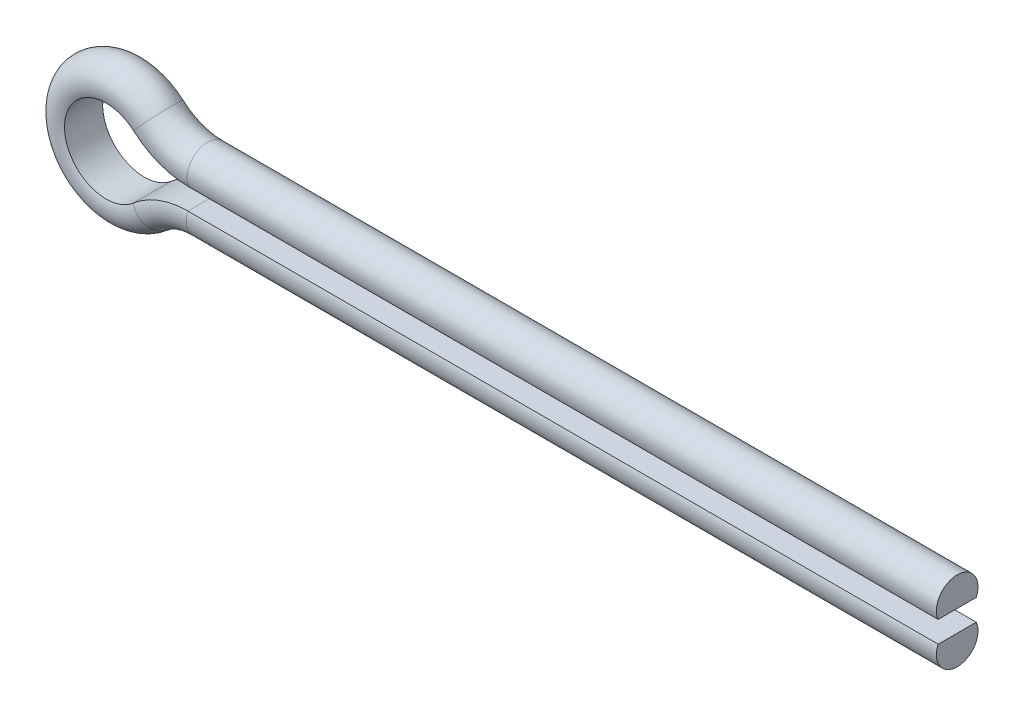
ISO-10303-21;
HEADER;
FILE_DESCRIPTION(('STEP AP214'),'2;1');
FILE_NAME('part.step','',(''),(''),'','','');
FILE_SCHEMA(('AUTOMOTIVE_DESIGN { 1 0 10303 214 1 1 1 1 }'));
ENDSEC;
DATA;
#1=APPLICATION_CONTEXT('core data for automotive mechanical design processes');
#2=APPLICATION_PROTOCOL_DEFINITION('international standard','automotive_design',2000,#1);
#3=PRODUCT_CONTEXT('',#1,'mechanical');
#4=PRODUCT('Part','Part','',(#3));
#5=PRODUCT_RELATED_PRODUCT_CATEGORY('part','',(#4));
#6=PRODUCT_DEFINITION_FORMATION('','',#4);
#7=PRODUCT_DEFINITION_CONTEXT('part definition',#1,'design');
#8=PRODUCT_DEFINITION('design','',#6,#7);
#9=PRODUCT_DEFINITION_SHAPE('','',#8);
#10=(LENGTH_UNIT() NAMED_UNIT(*) SI_UNIT(.MILLI.,.METRE.));
#11=(NAMED_UNIT(*) PLANE_ANGLE_UNIT() SI_UNIT($,.RADIAN.));
#12=(NAMED_UNIT(*) SI_UNIT($,.STERADIAN.) SOLID_ANGLE_UNIT());
#13=UNCERTAINTY_MEASURE_WITH_UNIT(LENGTH_MEASURE(1.E-05),#10,'distance_accuracy_value','');
#14=(GEOMETRIC_REPRESENTATION_CONTEXT(3) GLOBAL_UNCERTAINTY_ASSIGNED_CONTEXT((#13)) GLOBAL_UNIT_ASSIGNED_CONTEXT((#10,
#11,#12)) REPRESENTATION_CONTEXT('',''));
#15=CARTESIAN_POINT('',(0.,0.,0.));
#16=DIRECTION('',(0.,0.,1.));
#17=DIRECTION('',(1.,0.,0.));
#18=AXIS2_PLACEMENT_3D('',#15,#16,#17);
#19=CARTESIAN_POINT('',(0.,1.,0.));
#20=DIRECTION('',(-1.,0.,0.));
#21=DIRECTION('',(0.,0.,1.));
#22=AXIS2_PLACEMENT_3D('',#19,#20,#21);
#23=PLANE('',#22);
#24=CARTESIAN_POINT('',(0.,1.,0.));
#25=DIRECTION('',(1.,0.,0.));
#26=DIRECTION('',(0.,0.,1.));
#27=AXIS2_PLACEMENT_3D('',#24,#25,#26);
#28=CIRCLE('',#27,2.5);
#29=CARTESIAN_POINT('',(0.,0.,-2.29128784747792));
#30=VERTEX_POINT('',#29);
#31=CARTESIAN_POINT('',(0.,0.,2.29128784747792));
#32=VERTEX_POINT('',#31);
#33=EDGE_CURVE('E91',#30,#32,#28,.T.);
#34=ORIENTED_EDGE('',*,*,#33,.T.);
#35=DIRECTION('',(0.,0.,-1.));
#36=VECTOR('',#35,1.);
#37=CARTESIAN_POINT('',(0.,0.,-2.29128784747792));
#38=LINE('',#37,#36);
#39=EDGE_CURVE('E101',#32,#30,#38,.T.);
#40=ORIENTED_EDGE('',*,*,#39,.T.);
#41=EDGE_LOOP('',(#34,#40));
#42=FACE_BOUND('',#41,.T.);
#43=ADVANCED_FACE('F39',(#42),#23,.F.);
#44=CARTESIAN_POINT('',(0.,-3.57865887050988,0.));
#45=DIRECTION('',(1.,0.,0.));
#46=DIRECTION('',(0.,0.,1.));
#47=AXIS2_PLACEMENT_3D('',#44,#45,#46);
#48=PLANE('',#47);
#49=CARTESIAN_POINT('',(0.,-3.57865887050988,0.));
#50=DIRECTION('',(-1.,0.,0.));
#51=DIRECTION('',(0.,0.,1.));
#52=AXIS2_PLACEMENT_3D('',#49,#50,#51);
#53=CIRCLE('',#52,2.5);
#54=CARTESIAN_POINT('',(0.,-2.57865887050988,-2.29128784747792));
#55=VERTEX_POINT('',#54);
#56=CARTESIAN_POINT('',(0.,-2.57865887050988,2.29128784747792));
#57=VERTEX_POINT('',#56);
#58=EDGE_CURVE('E54',#55,#57,#53,.T.);
#59=ORIENTED_EDGE('',*,*,#58,.F.);
#60=DIRECTION('',(0.,0.,-1.));
#61=VECTOR('',#60,1.);
#62=CARTESIAN_POINT('',(0.,-2.57865887050988,-2.29128784747792));
#63=LINE('',#62,#61);
#64=EDGE_CURVE('E11',#57,#55,#63,.T.);
#65=ORIENTED_EDGE('',*,*,#64,.F.);
#66=EDGE_LOOP('',(#59,#65));
#67=FACE_BOUND('',#66,.T.);
#68=ADVANCED_FACE('F211',(#67),#48,.T.);
#69=CARTESIAN_POINT('',(0.,1.,0.));
#70=DIRECTION('',(-1.,0.,0.));
#71=DIRECTION('',(0.,-1.,0.));
#72=AXIS2_PLACEMENT_3D('',#69,#70,#71);
#73=CYLINDRICAL_SURFACE('',#72,2.5);
#74=DIRECTION('',(-1.,0.,0.));
#75=VECTOR('',#74,1.);
#76=CARTESIAN_POINT('',(0.,0.,2.29128784747792));
#77=LINE('',#76,#75);
#78=CARTESIAN_POINT('',(-90.0784325835078,0.,2.29128784747792));
#79=VERTEX_POINT('',#78);
#80=EDGE_CURVE('E98',#32,#79,#77,.T.);
#81=ORIENTED_EDGE('',*,*,#80,.F.);
#82=ORIENTED_EDGE('',*,*,#33,.F.);
#83=DIRECTION('',(-1.,0.,0.));
#84=VECTOR('',#83,1.);
#85=CARTESIAN_POINT('',(0.,0.,-2.29128784747792));
#86=LINE('',#85,#84);
#87=CARTESIAN_POINT('',(-90.0784325835078,0.,-2.29128784747792));
#88=VERTEX_POINT('',#87);
#89=EDGE_CURVE('E96',#30,#88,#86,.T.);
#90=ORIENTED_EDGE('',*,*,#89,.T.);
#91=CARTESIAN_POINT('',(-90.0784325835078,1.,0.));
#92=DIRECTION('',(1.,0.,0.));
#93=DIRECTION('',(0.,0.,1.));
#94=AXIS2_PLACEMENT_3D('',#91,#92,#93);
#95=CIRCLE('',#94,2.5);
#96=EDGE_CURVE('E112',#88,#79,#95,.T.);
#97=ORIENTED_EDGE('',*,*,#96,.T.);
#98=EDGE_LOOP('',(#81,#82,#90,#97));
#99=FACE_BOUND('',#98,.T.);
#100=ADVANCED_FACE('F93',(#99),#73,.T.);
#101=CARTESIAN_POINT('',(0.,0.,-2.29128784747792));
#102=DIRECTION('',(0.,1.,0.));
#103=DIRECTION('',(0.,0.,1.));
#104=AXIS2_PLACEMENT_3D('',#101,#102,#103);
#105=PLANE('',#104);
#106=DIRECTION('',(0.,0.,-1.));
#107=VECTOR('',#106,1.);
#108=CARTESIAN_POINT('',(-90.0784325835078,0.,-2.29128784747792));
#109=LINE('',#108,#107);
#110=EDGE_CURVE('E109',#79,#88,#109,.T.);
#111=ORIENTED_EDGE('',*,*,#110,.T.);
#112=ORIENTED_EDGE('',*,*,#89,.F.);
#113=ORIENTED_EDGE('',*,*,#39,.F.);
#114=ORIENTED_EDGE('',*,*,#80,.T.);
#115=EDGE_LOOP('',(#111,#112,#113,#114));
#116=FACE_BOUND('',#115,.T.);
#117=ADVANCED_FACE('F107',(#116),#105,.F.);
#118=CARTESIAN_POINT('',(-90.0784325835078,10.,0.));
#119=DIRECTION('',(0.,0.,-1.));
#120=DIRECTION('',(-1.,0.,0.));
#121=AXIS2_PLACEMENT_3D('',#118,#119,#120);
#122=TOROIDAL_SURFACE('',#121,9.,2.5);
#123=CARTESIAN_POINT('',(-90.0784325835078,10.,2.29128784747792));
#124=DIRECTION('',(0.,0.,-1.));
#125=DIRECTION('',(0.,-1.,0.));
#126=AXIS2_PLACEMENT_3D('',#123,#124,#125);
#127=CIRCLE('',#126,10.);
#128=CARTESIAN_POINT('',(-96.6928108611693,2.5,2.29128784747792));
#129=VERTEX_POINT('',#128);
#130=EDGE_CURVE('E122',#79,#129,#127,.T.);
#131=ORIENTED_EDGE('',*,*,#130,.F.);
#132=ORIENTED_EDGE('',*,*,#96,.F.);
#133=CARTESIAN_POINT('',(-90.0784325835078,10.,-2.29128784747792));
#134=DIRECTION('',(0.,0.,-1.));
#135=DIRECTION('',(0.,-1.,0.));
#136=AXIS2_PLACEMENT_3D('',#133,#134,#135);
#137=CIRCLE('',#136,10.);
#138=CARTESIAN_POINT('',(-96.6928108611693,2.5,-2.29128784747792));
#139=VERTEX_POINT('',#138);
#140=EDGE_CURVE('E123',#88,#139,#137,.T.);
#141=ORIENTED_EDGE('',*,*,#140,.T.);
#142=CARTESIAN_POINT('',(-96.0313730334031,3.25,0.));
#143=DIRECTION('',(0.750000000000001,-0.661437827766147,0.));
#144=DIRECTION('',(0.,0.,1.));
#145=AXIS2_PLACEMENT_3D('',#142,#143,#144);
#146=CIRCLE('',#145,2.5);
#147=EDGE_CURVE('E118',#139,#129,#146,.T.);
#148=ORIENTED_EDGE('',*,*,#147,.T.);
#149=EDGE_LOOP('',(#131,#132,#141,#148));
#150=FACE_BOUND('',#149,.T.);
#151=ADVANCED_FACE('F191',(#150),#122,.T.);
#152=CARTESIAN_POINT('',(-90.0784325835078,10.,0.));
#153=DIRECTION('',(0.,0.,-1.));
#154=DIRECTION('',(-1.,0.,0.));
#155=AXIS2_PLACEMENT_3D('',#152,#153,#154);
#156=CYLINDRICAL_SURFACE('',#155,10.);
#157=DIRECTION('',(0.,0.,-1.));
#158=VECTOR('',#157,1.);
#159=CARTESIAN_POINT('',(-96.6928108611693,2.5,-2.29128784747792));
#160=LINE('',#159,#158);
#161=EDGE_CURVE('E127',#129,#139,#160,.T.);
#162=ORIENTED_EDGE('',*,*,#161,.T.);
#163=ORIENTED_EDGE('',*,*,#140,.F.);
#164=ORIENTED_EDGE('',*,*,#110,.F.);
#165=ORIENTED_EDGE('',*,*,#130,.T.);
#166=EDGE_LOOP('',(#162,#163,#164,#165));
#167=FACE_BOUND('',#166,.T.);
#168=ADVANCED_FACE('F189',(#167),#156,.T.);
#169=CARTESIAN_POINT('',(-100.,-1.24999999999999,0.));
#170=DIRECTION('',(0.,0.,1.));
#171=DIRECTION('',(1.,0.,0.));
#172=AXIS2_PLACEMENT_3D('',#169,#170,#171);
#173=TOROIDAL_SURFACE('',#172,6.,2.5);
#174=CARTESIAN_POINT('',(-100.,-1.24999999999999,2.29128784747792));
#175=DIRECTION('',(0.,0.,1.));
#176=DIRECTION('',(0.661437827766148,0.75,0.));
#177=AXIS2_PLACEMENT_3D('',#174,#175,#176);
#178=CIRCLE('',#177,5.);
#179=CARTESIAN_POINT('',(-96.722780850314,-5.02621962350329,2.29128784747792));
#180=VERTEX_POINT('',#179);
#181=EDGE_CURVE('E135',#129,#180,#178,.T.);
#182=ORIENTED_EDGE('',*,*,#181,.F.);
#183=ORIENTED_EDGE('',*,*,#147,.F.);
#184=CARTESIAN_POINT('',(-100.,-1.24999999999999,-2.29128784747792));
#185=DIRECTION('',(0.,0.,1.));
#186=DIRECTION('',(0.661437827766148,0.75,0.));
#187=AXIS2_PLACEMENT_3D('',#184,#185,#186);
#188=CIRCLE('',#187,5.);
#189=CARTESIAN_POINT('',(-96.722780850314,-5.02621962350329,-2.29128784747792));
#190=VERTEX_POINT('',#189);
#191=EDGE_CURVE('E136',#139,#190,#188,.T.);
#192=ORIENTED_EDGE('',*,*,#191,.T.);
#193=CARTESIAN_POINT('',(-96.0673370203768,-5.78146354820395,0.));
#194=DIRECTION('',(-0.75524392470066,-0.655443829937199,0.));
#195=DIRECTION('',(0.,0.,1.));
#196=AXIS2_PLACEMENT_3D('',#193,#194,#195);
#197=CIRCLE('',#196,2.5);
#198=EDGE_CURVE('E131',#190,#180,#197,.T.);
#199=ORIENTED_EDGE('',*,*,#198,.T.);
#200=EDGE_LOOP('',(#182,#183,#192,#199));
#201=FACE_BOUND('',#200,.T.);
#202=ADVANCED_FACE('F184',(#201),#173,.T.);
#203=CARTESIAN_POINT('',(-100.,-1.24999999999999,0.));
#204=DIRECTION('',(0.,0.,1.));
#205=DIRECTION('',(1.,0.,0.));
#206=AXIS2_PLACEMENT_3D('',#203,#204,#205);
#207=CYLINDRICAL_SURFACE('',#206,5.);
#208=DIRECTION('',(0.,0.,-1.));
#209=VECTOR('',#208,1.);
#210=CARTESIAN_POINT('',(-96.722780850314,-5.02621962350329,-2.29128784747792));
#211=LINE('',#210,#209);
#212=EDGE_CURVE('E140',#180,#190,#211,.T.);
#213=ORIENTED_EDGE('',*,*,#212,.T.);
#214=ORIENTED_EDGE('',*,*,#191,.F.);
#215=ORIENTED_EDGE('',*,*,#161,.F.);
#216=ORIENTED_EDGE('',*,*,#181,.T.);
#217=EDGE_LOOP('',(#213,#214,#215,#216));
#218=FACE_BOUND('',#217,.T.);
#219=ADVANCED_FACE('F187',(#218),#207,.F.);
#220=CARTESIAN_POINT('',(-90.168342550942,-12.5786588705099,0.));
#221=DIRECTION('',(0.,0.,-1.));
#222=DIRECTION('',(-1.,0.,0.));
#223=AXIS2_PLACEMENT_3D('',#220,#221,#222);
#224=TOROIDAL_SURFACE('',#223,9.00000000000001,2.5);
#225=CARTESIAN_POINT('',(-90.168342550942,-12.5786588705099,2.29128784747792));
#226=DIRECTION('',(0.,0.,-1.));
#227=DIRECTION('',(-0.655443829937201,0.755243924700658,0.));
#228=AXIS2_PLACEMENT_3D('',#225,#226,#227);
#229=CIRCLE('',#228,10.);
#230=CARTESIAN_POINT('',(-90.168342550942,-2.57865887050988,2.29128784747792));
#231=VERTEX_POINT('',#230);
#232=EDGE_CURVE('E148',#180,#231,#229,.T.);
#233=ORIENTED_EDGE('',*,*,#232,.F.);
#234=ORIENTED_EDGE('',*,*,#198,.F.);
#235=CARTESIAN_POINT('',(-90.168342550942,-12.5786588705099,-2.29128784747792));
#236=DIRECTION('',(0.,0.,-1.));
#237=DIRECTION('',(-0.655443829937201,0.755243924700658,0.));
#238=AXIS2_PLACEMENT_3D('',#235,#236,#237);
#239=CIRCLE('',#238,10.);
#240=CARTESIAN_POINT('',(-90.168342550942,-2.57865887050988,-2.29128784747792));
#241=VERTEX_POINT('',#240);
#242=EDGE_CURVE('E149',#190,#241,#239,.T.);
#243=ORIENTED_EDGE('',*,*,#242,.T.);
#244=CARTESIAN_POINT('',(-90.168342550942,-3.57865887050988,0.));
#245=DIRECTION('',(-1.,0.,0.));
#246=DIRECTION('',(0.,0.,1.));
#247=AXIS2_PLACEMENT_3D('',#244,#245,#246);
#248=CIRCLE('',#247,2.5);
#249=EDGE_CURVE('E144',#241,#231,#248,.T.);
#250=ORIENTED_EDGE('',*,*,#249,.T.);
#251=EDGE_LOOP('',(#233,#234,#243,#250));
#252=FACE_BOUND('',#251,.T.);
#253=ADVANCED_FACE('F181',(#252),#224,.T.);
#254=CARTESIAN_POINT('',(-90.168342550942,-12.5786588705099,0.));
#255=DIRECTION('',(0.,0.,-1.));
#256=DIRECTION('',(-1.,0.,0.));
#257=AXIS2_PLACEMENT_3D('',#254,#255,#256);
#258=CYLINDRICAL_SURFACE('',#257,10.);
#259=DIRECTION('',(0.,0.,-1.));
#260=VECTOR('',#259,1.);
#261=CARTESIAN_POINT('',(-90.168342550942,-2.57865887050988,-2.29128784747792));
#262=LINE('',#261,#260);
#263=EDGE_CURVE('E153',#231,#241,#262,.T.);
#264=ORIENTED_EDGE('',*,*,#263,.T.);
#265=ORIENTED_EDGE('',*,*,#242,.F.);
#266=ORIENTED_EDGE('',*,*,#212,.F.);
#267=ORIENTED_EDGE('',*,*,#232,.T.);
#268=EDGE_LOOP('',(#264,#265,#266,#267));
#269=FACE_BOUND('',#268,.T.);
#270=ADVANCED_FACE('F176',(#269),#258,.T.);
#271=CARTESIAN_POINT('',(-90.168342550942,-3.57865887050988,0.));
#272=DIRECTION('',(1.,0.,0.));
#273=DIRECTION('',(0.,1.,0.));
#274=AXIS2_PLACEMENT_3D('',#271,#272,#273);
#275=CYLINDRICAL_SURFACE('',#274,2.5);
#276=DIRECTION('',(1.,0.,0.));
#277=VECTOR('',#276,1.);
#278=CARTESIAN_POINT('',(-90.168342550942,-2.57865887050988,2.29128784747792));
#279=LINE('',#278,#277);
#280=EDGE_CURVE('E47',#231,#57,#279,.T.);
#281=ORIENTED_EDGE('',*,*,#280,.F.);
#282=ORIENTED_EDGE('',*,*,#249,.F.);
#283=DIRECTION('',(1.,0.,0.));
#284=VECTOR('',#283,1.);
#285=CARTESIAN_POINT('',(-90.168342550942,-2.57865887050988,-2.29128784747792));
#286=LINE('',#285,#284);
#287=EDGE_CURVE('E159',#241,#55,#286,.T.);
#288=ORIENTED_EDGE('',*,*,#287,.T.);
#289=ORIENTED_EDGE('',*,*,#58,.T.);
#290=EDGE_LOOP('',(#281,#282,#288,#289));
#291=FACE_BOUND('',#290,.T.);
#292=ADVANCED_FACE('F178',(#291),#275,.T.);
#293=CARTESIAN_POINT('',(-90.168342550942,-2.57865887050988,-2.29128784747792));
#294=DIRECTION('',(0.,-1.,0.));
#295=DIRECTION('',(0.,0.,-1.));
#296=AXIS2_PLACEMENT_3D('',#293,#294,#295);
#297=PLANE('',#296);
#298=ORIENTED_EDGE('',*,*,#64,.T.);
#299=ORIENTED_EDGE('',*,*,#287,.F.);
#300=ORIENTED_EDGE('',*,*,#263,.F.);
#301=ORIENTED_EDGE('',*,*,#280,.T.);
#302=EDGE_LOOP('',(#298,#299,#300,#301));
#303=FACE_BOUND('',#302,.T.);
#304=ADVANCED_FACE('F202',(#303),#297,.F.);
#305=CLOSED_SHELL('',(#43,#68,#100,#117,#151,#168,#202,#219,#253,#270,#292,#304));
#306=MANIFOLD_SOLID_BREP('B2',#305);
#307=ADVANCED_BREP_SHAPE_REPRESENTATION('',(#18,#306),#14);
#308=SHAPE_DEFINITION_REPRESENTATION(#9,#307);
ENDSEC;
END-ISO-10303-21;
